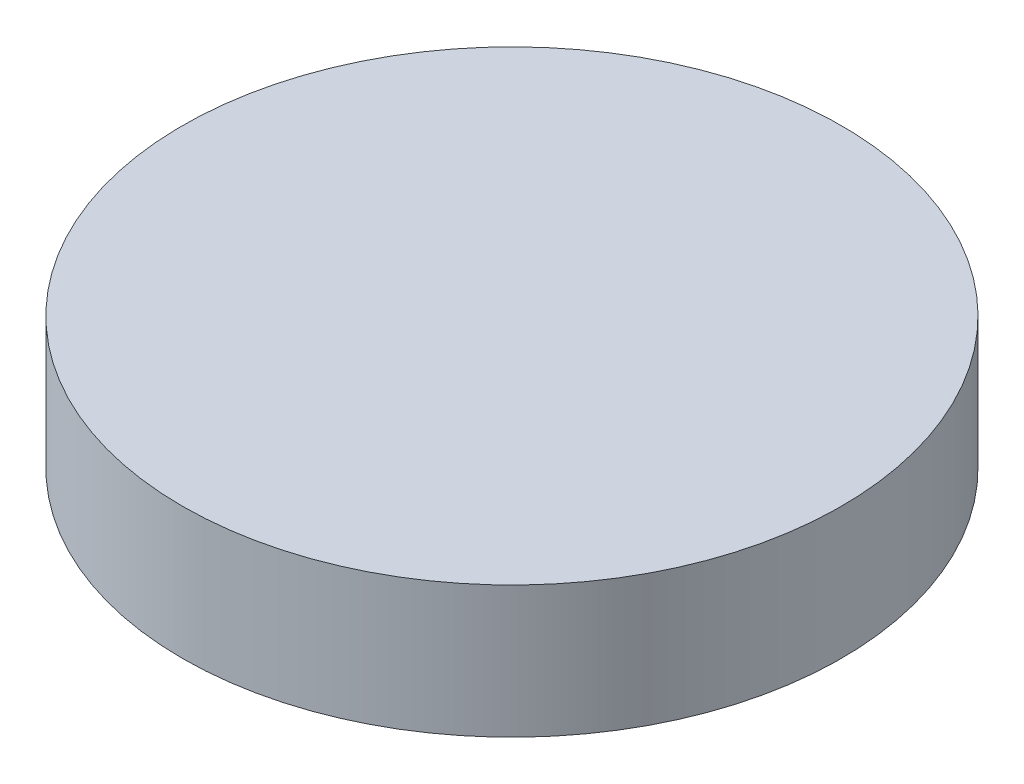
ISO-10303-21;
HEADER;
FILE_DESCRIPTION(('STEP AP214'),'2;1');
FILE_NAME('part.step','',(''),(''),'','','');
FILE_SCHEMA(('AUTOMOTIVE_DESIGN { 1 0 10303 214 1 1 1 1 }'));
ENDSEC;
DATA;
#1=APPLICATION_CONTEXT('core data for automotive mechanical design processes');
#2=APPLICATION_PROTOCOL_DEFINITION('international standard','automotive_design',2000,#1);
#3=PRODUCT_CONTEXT('',#1,'mechanical');
#4=PRODUCT('Part','Part','',(#3));
#5=PRODUCT_RELATED_PRODUCT_CATEGORY('part','',(#4));
#6=PRODUCT_DEFINITION_FORMATION('','',#4);
#7=PRODUCT_DEFINITION_CONTEXT('part definition',#1,'design');
#8=PRODUCT_DEFINITION('design','',#6,#7);
#9=PRODUCT_DEFINITION_SHAPE('','',#8);
#10=(LENGTH_UNIT() NAMED_UNIT(*) SI_UNIT(.MILLI.,.METRE.));
#11=(NAMED_UNIT(*) PLANE_ANGLE_UNIT() SI_UNIT($,.RADIAN.));
#12=(NAMED_UNIT(*) SI_UNIT($,.STERADIAN.) SOLID_ANGLE_UNIT());
#13=UNCERTAINTY_MEASURE_WITH_UNIT(LENGTH_MEASURE(1.E-05),#10,'distance_accuracy_value','');
#14=(GEOMETRIC_REPRESENTATION_CONTEXT(3) GLOBAL_UNCERTAINTY_ASSIGNED_CONTEXT((#13)) GLOBAL_UNIT_ASSIGNED_CONTEXT((#10,
#11,#12)) REPRESENTATION_CONTEXT('',''));
#15=CARTESIAN_POINT('',(0.,0.,0.));
#16=DIRECTION('',(0.,0.,1.));
#17=DIRECTION('',(1.,0.,0.));
#18=AXIS2_PLACEMENT_3D('',#15,#16,#17);
#19=CARTESIAN_POINT('',(0.,2.,0.));
#20=DIRECTION('',(0.,-1.,0.));
#21=DIRECTION('',(0.,0.,-1.));
#22=AXIS2_PLACEMENT_3D('',#19,#20,#21);
#23=CYLINDRICAL_SURFACE('',#22,5.);
#24=CARTESIAN_POINT('',(0.,2.,0.));
#25=DIRECTION('',(0.,1.,0.));
#26=DIRECTION('',(0.,0.,1.));
#27=AXIS2_PLACEMENT_3D('',#24,#25,#26);
#28=CIRCLE('',#27,5.);
#29=CARTESIAN_POINT('',(0.,2.,5.));
#30=VERTEX_POINT('',#29);
#31=EDGE_CURVE('E10',#30,#30,#28,.T.);
#32=ORIENTED_EDGE('',*,*,#31,.F.);
#33=EDGE_LOOP('',(#32));
#34=FACE_BOUND('',#33,.T.);
#35=CARTESIAN_POINT('',(0.,0.,0.));
#36=DIRECTION('',(0.,1.,0.));
#37=DIRECTION('',(0.,0.,1.));
#38=AXIS2_PLACEMENT_3D('',#35,#36,#37);
#39=CIRCLE('',#38,5.);
#40=CARTESIAN_POINT('',(0.,0.,5.));
#41=VERTEX_POINT('',#40);
#42=EDGE_CURVE('E34',#41,#41,#39,.T.);
#43=ORIENTED_EDGE('',*,*,#42,.T.);
#44=EDGE_LOOP('',(#43));
#45=FACE_BOUND('',#44,.T.);
#46=ADVANCED_FACE('F31',(#34,#45),#23,.T.);
#47=CARTESIAN_POINT('',(0.,2.,0.));
#48=DIRECTION('',(0.,1.,0.));
#49=DIRECTION('',(0.,0.,1.));
#50=AXIS2_PLACEMENT_3D('',#47,#48,#49);
#51=PLANE('',#50);
#52=ORIENTED_EDGE('',*,*,#31,.T.);
#53=EDGE_LOOP('',(#52));
#54=FACE_BOUND('',#53,.T.);
#55=ADVANCED_FACE('F46',(#54),#51,.T.);
#56=CARTESIAN_POINT('',(0.,0.,0.));
#57=DIRECTION('',(0.,1.,0.));
#58=DIRECTION('',(0.,0.,1.));
#59=AXIS2_PLACEMENT_3D('',#56,#57,#58);
#60=PLANE('',#59);
#61=ORIENTED_EDGE('',*,*,#42,.F.);
#62=EDGE_LOOP('',(#61));
#63=FACE_BOUND('',#62,.T.);
#64=ADVANCED_FACE('F44',(#63),#60,.F.);
#65=CLOSED_SHELL('',(#46,#55,#64));
#66=MANIFOLD_SOLID_BREP('B2',#65);
#67=ADVANCED_BREP_SHAPE_REPRESENTATION('',(#18,#66),#14);
#68=SHAPE_DEFINITION_REPRESENTATION(#9,#67);
ENDSEC;
END-ISO-10303-21;
